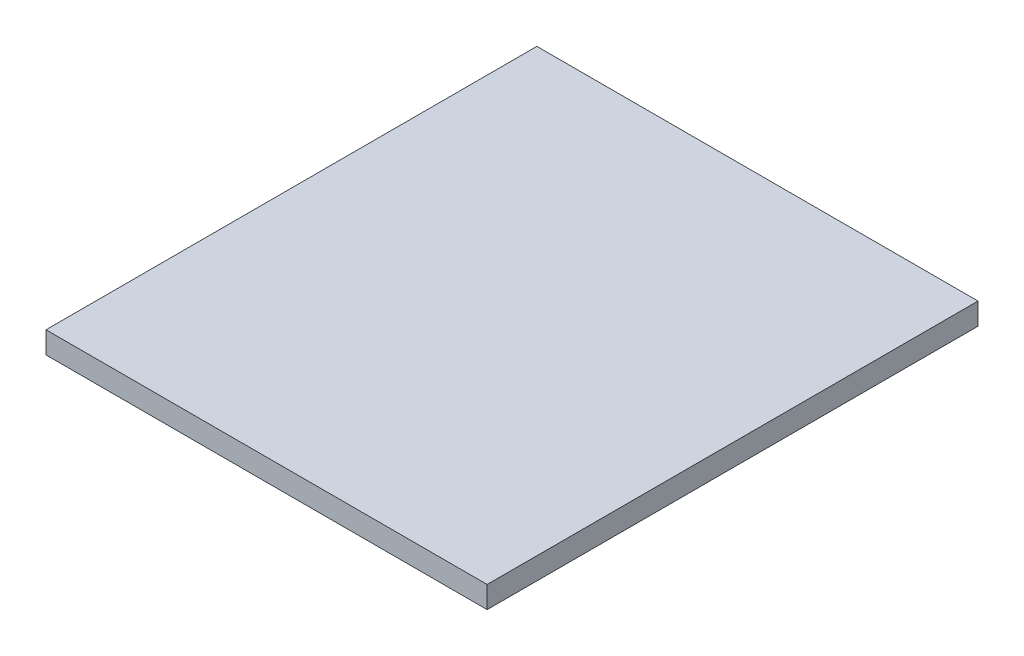
ISO-10303-21;
HEADER;
FILE_DESCRIPTION(('STEP AP214'),'2;1');
FILE_NAME('part.step','',(''),(''),'','','');
FILE_SCHEMA(('AUTOMOTIVE_DESIGN { 1 0 10303 214 1 1 1 1 }'));
ENDSEC;
DATA;
#1=APPLICATION_CONTEXT('core data for automotive mechanical design processes');
#2=APPLICATION_PROTOCOL_DEFINITION('international standard','automotive_design',2000,#1);
#3=PRODUCT_CONTEXT('',#1,'mechanical');
#4=PRODUCT('Part','Part','',(#3));
#5=PRODUCT_RELATED_PRODUCT_CATEGORY('part','',(#4));
#6=PRODUCT_DEFINITION_FORMATION('','',#4);
#7=PRODUCT_DEFINITION_CONTEXT('part definition',#1,'design');
#8=PRODUCT_DEFINITION('design','',#6,#7);
#9=PRODUCT_DEFINITION_SHAPE('','',#8);
#10=(LENGTH_UNIT() NAMED_UNIT(*) SI_UNIT(.MILLI.,.METRE.));
#11=(NAMED_UNIT(*) PLANE_ANGLE_UNIT() SI_UNIT($,.RADIAN.));
#12=(NAMED_UNIT(*) SI_UNIT($,.STERADIAN.) SOLID_ANGLE_UNIT());
#13=UNCERTAINTY_MEASURE_WITH_UNIT(LENGTH_MEASURE(1.E-05),#10,'distance_accuracy_value','');
#14=(GEOMETRIC_REPRESENTATION_CONTEXT(3) GLOBAL_UNCERTAINTY_ASSIGNED_CONTEXT((#13)) GLOBAL_UNIT_ASSIGNED_CONTEXT((#10,
#11,#12)) REPRESENTATION_CONTEXT('',''));
#15=CARTESIAN_POINT('',(0.,0.,0.));
#16=DIRECTION('',(0.,0.,1.));
#17=DIRECTION('',(1.,0.,0.));
#18=AXIS2_PLACEMENT_3D('',#15,#16,#17);
#19=CARTESIAN_POINT('',(0.,1.,0.));
#20=DIRECTION('',(1.,0.,0.));
#21=DIRECTION('',(0.,0.,-1.));
#22=AXIS2_PLACEMENT_3D('',#19,#20,#21);
#23=PLANE('',#22);
#24=DIRECTION('',(0.,0.,1.));
#25=VECTOR('',#24,1.);
#26=CARTESIAN_POINT('',(0.,0.,0.));
#27=LINE('',#26,#25);
#28=CARTESIAN_POINT('',(0.,0.,-22.5));
#29=VERTEX_POINT('',#28);
#30=CARTESIAN_POINT('',(0.,0.,0.));
#31=VERTEX_POINT('',#30);
#32=EDGE_CURVE('E96',#29,#31,#27,.T.);
#33=ORIENTED_EDGE('',*,*,#32,.T.);
#34=DIRECTION('',(0.,-1.,0.));
#35=VECTOR('',#34,1.);
#36=CARTESIAN_POINT('',(0.,1.,0.));
#37=LINE('',#36,#35);
#38=CARTESIAN_POINT('',(0.,1.,0.));
#39=VERTEX_POINT('',#38);
#40=EDGE_CURVE('E11',#39,#31,#37,.T.);
#41=ORIENTED_EDGE('',*,*,#40,.F.);
#42=DIRECTION('',(0.,0.,1.));
#43=VECTOR('',#42,1.);
#44=CARTESIAN_POINT('',(0.,1.,0.));
#45=LINE('',#44,#43);
#46=CARTESIAN_POINT('',(0.,1.,-22.5));
#47=VERTEX_POINT('',#46);
#48=EDGE_CURVE('E84',#47,#39,#45,.T.);
#49=ORIENTED_EDGE('',*,*,#48,.F.);
#50=DIRECTION('',(0.,-1.,0.));
#51=VECTOR('',#50,1.);
#52=CARTESIAN_POINT('',(0.,1.,-22.5));
#53=LINE('',#52,#51);
#54=EDGE_CURVE('E92',#47,#29,#53,.T.);
#55=ORIENTED_EDGE('',*,*,#54,.T.);
#56=EDGE_LOOP('',(#33,#41,#49,#55));
#57=FACE_BOUND('',#56,.T.);
#58=ADVANCED_FACE('F33',(#57),#23,.F.);
#59=CARTESIAN_POINT('',(0.,1.,0.));
#60=DIRECTION('',(0.,0.,-1.));
#61=DIRECTION('',(-1.,0.,0.));
#62=AXIS2_PLACEMENT_3D('',#59,#60,#61);
#63=PLANE('',#62);
#64=DIRECTION('',(1.,0.,0.));
#65=VECTOR('',#64,1.);
#66=CARTESIAN_POINT('',(0.,0.,0.));
#67=LINE('',#66,#65);
#68=CARTESIAN_POINT('',(20.22,0.,0.));
#69=VERTEX_POINT('',#68);
#70=EDGE_CURVE('E88',#31,#69,#67,.T.);
#71=ORIENTED_EDGE('',*,*,#70,.T.);
#72=DIRECTION('',(0.,-1.,0.));
#73=VECTOR('',#72,1.);
#74=CARTESIAN_POINT('',(20.22,1.,0.));
#75=LINE('',#74,#73);
#76=CARTESIAN_POINT('',(20.22,1.,0.));
#77=VERTEX_POINT('',#76);
#78=EDGE_CURVE('E41',#77,#69,#75,.T.);
#79=ORIENTED_EDGE('',*,*,#78,.F.);
#80=DIRECTION('',(1.,0.,0.));
#81=VECTOR('',#80,1.);
#82=CARTESIAN_POINT('',(0.,1.,0.));
#83=LINE('',#82,#81);
#84=EDGE_CURVE('E79',#39,#77,#83,.T.);
#85=ORIENTED_EDGE('',*,*,#84,.F.);
#86=ORIENTED_EDGE('',*,*,#40,.T.);
#87=EDGE_LOOP('',(#71,#79,#85,#86));
#88=FACE_BOUND('',#87,.T.);
#89=ADVANCED_FACE('F87',(#88),#63,.F.);
#90=CARTESIAN_POINT('',(20.22,1.,0.));
#91=DIRECTION('',(-1.,0.,0.));
#92=DIRECTION('',(0.,0.,1.));
#93=AXIS2_PLACEMENT_3D('',#90,#91,#92);
#94=PLANE('',#93);
#95=DIRECTION('',(0.,0.,-1.));
#96=VECTOR('',#95,1.);
#97=CARTESIAN_POINT('',(20.22,0.,0.));
#98=LINE('',#97,#96);
#99=CARTESIAN_POINT('',(20.22,0.,-22.5));
#100=VERTEX_POINT('',#99);
#101=EDGE_CURVE('E66',#69,#100,#98,.T.);
#102=ORIENTED_EDGE('',*,*,#101,.T.);
#103=DIRECTION('',(0.,-1.,0.));
#104=VECTOR('',#103,1.);
#105=CARTESIAN_POINT('',(20.22,1.,-22.5));
#106=LINE('',#105,#104);
#107=CARTESIAN_POINT('',(20.22,1.,-22.5));
#108=VERTEX_POINT('',#107);
#109=EDGE_CURVE('E89',#108,#100,#106,.T.);
#110=ORIENTED_EDGE('',*,*,#109,.F.);
#111=DIRECTION('',(0.,0.,-1.));
#112=VECTOR('',#111,1.);
#113=CARTESIAN_POINT('',(20.22,1.,0.));
#114=LINE('',#113,#112);
#115=EDGE_CURVE('E82',#77,#108,#114,.T.);
#116=ORIENTED_EDGE('',*,*,#115,.F.);
#117=ORIENTED_EDGE('',*,*,#78,.T.);
#118=EDGE_LOOP('',(#102,#110,#116,#117));
#119=FACE_BOUND('',#118,.T.);
#120=ADVANCED_FACE('F90',(#119),#94,.F.);
#121=CARTESIAN_POINT('',(0.,1.,-22.5));
#122=DIRECTION('',(0.,0.,1.));
#123=DIRECTION('',(1.,0.,0.));
#124=AXIS2_PLACEMENT_3D('',#121,#122,#123);
#125=PLANE('',#124);
#126=DIRECTION('',(-1.,0.,0.));
#127=VECTOR('',#126,1.);
#128=CARTESIAN_POINT('',(0.,0.,-22.5));
#129=LINE('',#128,#127);
#130=EDGE_CURVE('E72',#100,#29,#129,.T.);
#131=ORIENTED_EDGE('',*,*,#130,.T.);
#132=ORIENTED_EDGE('',*,*,#54,.F.);
#133=DIRECTION('',(-1.,0.,0.));
#134=VECTOR('',#133,1.);
#135=CARTESIAN_POINT('',(0.,1.,-22.5));
#136=LINE('',#135,#134);
#137=EDGE_CURVE('E49',#108,#47,#136,.T.);
#138=ORIENTED_EDGE('',*,*,#137,.F.);
#139=ORIENTED_EDGE('',*,*,#109,.T.);
#140=EDGE_LOOP('',(#131,#132,#138,#139));
#141=FACE_BOUND('',#140,.T.);
#142=ADVANCED_FACE('F103',(#141),#125,.F.);
#143=CARTESIAN_POINT('',(0.,1.,0.));
#144=DIRECTION('',(0.,-1.,0.));
#145=DIRECTION('',(0.,0.,-1.));
#146=AXIS2_PLACEMENT_3D('',#143,#144,#145);
#147=PLANE('',#146);
#148=ORIENTED_EDGE('',*,*,#48,.T.);
#149=ORIENTED_EDGE('',*,*,#84,.T.);
#150=ORIENTED_EDGE('',*,*,#115,.T.);
#151=ORIENTED_EDGE('',*,*,#137,.T.);
#152=EDGE_LOOP('',(#148,#149,#150,#151));
#153=FACE_BOUND('',#152,.T.);
#154=ADVANCED_FACE('F80',(#153),#147,.F.);
#155=CARTESIAN_POINT('',(0.,0.,0.));
#156=DIRECTION('',(0.,-1.,0.));
#157=DIRECTION('',(0.,0.,-1.));
#158=AXIS2_PLACEMENT_3D('',#155,#156,#157);
#159=PLANE('',#158);
#160=ORIENTED_EDGE('',*,*,#32,.F.);
#161=ORIENTED_EDGE('',*,*,#130,.F.);
#162=ORIENTED_EDGE('',*,*,#101,.F.);
#163=ORIENTED_EDGE('',*,*,#70,.F.);
#164=EDGE_LOOP('',(#160,#161,#162,#163));
#165=FACE_BOUND('',#164,.T.);
#166=ADVANCED_FACE('F106',(#165),#159,.T.);
#167=CLOSED_SHELL('',(#58,#89,#120,#142,#154,#166));
#168=MANIFOLD_SOLID_BREP('B2',#167);
#169=ADVANCED_BREP_SHAPE_REPRESENTATION('',(#18,#168),#14);
#170=SHAPE_DEFINITION_REPRESENTATION(#9,#169);
ENDSEC;
END-ISO-10303-21;
